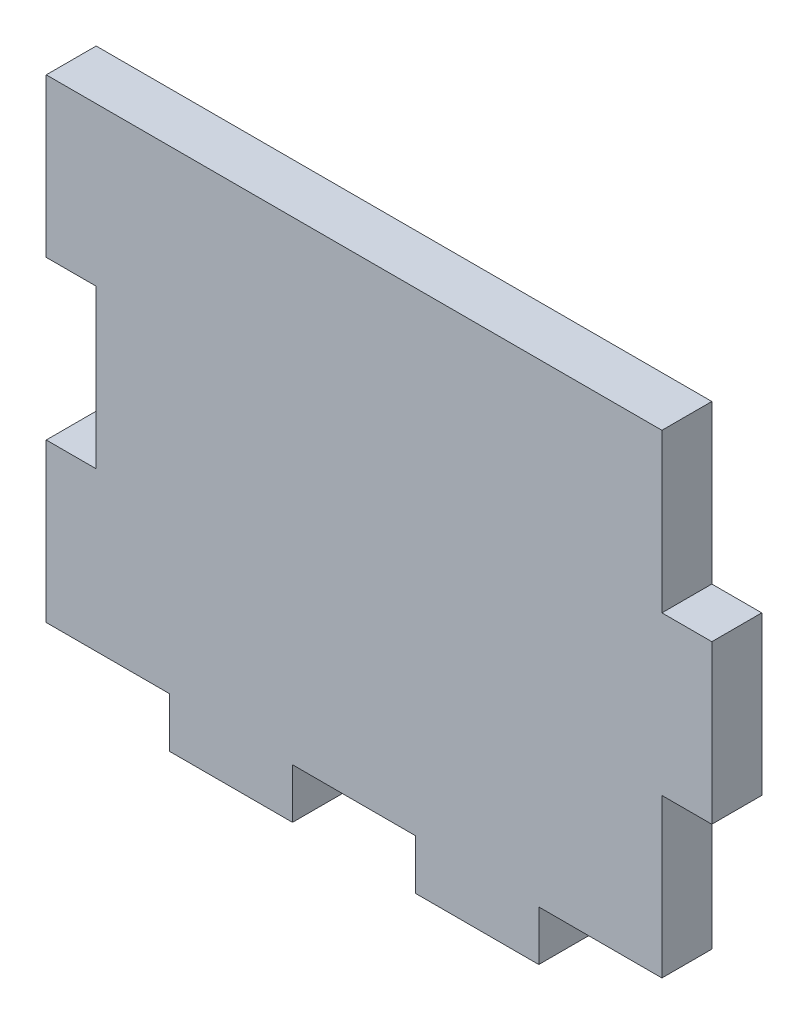
ISO-10303-21;
HEADER;
FILE_DESCRIPTION(('STEP AP214'),'2;1');
FILE_NAME('part.step','',(''),(''),'','','');
FILE_SCHEMA(('AUTOMOTIVE_DESIGN { 1 0 10303 214 1 1 1 1 }'));
ENDSEC;
DATA;
#1=APPLICATION_CONTEXT('core data for automotive mechanical design processes');
#2=APPLICATION_PROTOCOL_DEFINITION('international standard','automotive_design',2000,#1);
#3=PRODUCT_CONTEXT('',#1,'mechanical');
#4=PRODUCT('Part','Part','',(#3));
#5=PRODUCT_RELATED_PRODUCT_CATEGORY('part','',(#4));
#6=PRODUCT_DEFINITION_FORMATION('','',#4);
#7=PRODUCT_DEFINITION_CONTEXT('part definition',#1,'design');
#8=PRODUCT_DEFINITION('design','',#6,#7);
#9=PRODUCT_DEFINITION_SHAPE('','',#8);
#10=(LENGTH_UNIT() NAMED_UNIT(*) SI_UNIT(.MILLI.,.METRE.));
#11=(NAMED_UNIT(*) PLANE_ANGLE_UNIT() SI_UNIT($,.RADIAN.));
#12=(NAMED_UNIT(*) SI_UNIT($,.STERADIAN.) SOLID_ANGLE_UNIT());
#13=UNCERTAINTY_MEASURE_WITH_UNIT(LENGTH_MEASURE(1.E-05),#10,'distance_accuracy_value','');
#14=(GEOMETRIC_REPRESENTATION_CONTEXT(3) GLOBAL_UNCERTAINTY_ASSIGNED_CONTEXT((#13)) GLOBAL_UNIT_ASSIGNED_CONTEXT((#10,
#11,#12)) REPRESENTATION_CONTEXT('',''));
#15=CARTESIAN_POINT('',(0.,0.,0.));
#16=DIRECTION('',(0.,0.,1.));
#17=DIRECTION('',(1.,0.,0.));
#18=AXIS2_PLACEMENT_3D('',#15,#16,#17);
#19=CARTESIAN_POINT('',(0.,0.,4.5));
#20=DIRECTION('',(1.,0.,0.));
#21=DIRECTION('',(0.,0.,-1.));
#22=AXIS2_PLACEMENT_3D('',#19,#20,#21);
#23=PLANE('',#22);
#24=DIRECTION('',(0.,-1.,0.));
#25=VECTOR('',#24,1.);
#26=CARTESIAN_POINT('',(0.,0.,0.));
#27=LINE('',#26,#25);
#28=CARTESIAN_POINT('',(0.,14.2533333333333,0.));
#29=VERTEX_POINT('',#28);
#30=CARTESIAN_POINT('',(0.,0.,0.));
#31=VERTEX_POINT('',#30);
#32=EDGE_CURVE('E198',#29,#31,#27,.T.);
#33=ORIENTED_EDGE('',*,*,#32,.T.);
#34=DIRECTION('',(0.,0.,-1.));
#35=VECTOR('',#34,1.);
#36=CARTESIAN_POINT('',(0.,0.,4.5));
#37=LINE('',#36,#35);
#38=CARTESIAN_POINT('',(0.,0.,4.5));
#39=VERTEX_POINT('',#38);
#40=EDGE_CURVE('E11',#39,#31,#37,.T.);
#41=ORIENTED_EDGE('',*,*,#40,.F.);
#42=DIRECTION('',(0.,-1.,0.));
#43=VECTOR('',#42,1.);
#44=CARTESIAN_POINT('',(0.,0.,4.5));
#45=LINE('',#44,#43);
#46=CARTESIAN_POINT('',(0.,14.2533333333333,4.5));
#47=VERTEX_POINT('',#46);
#48=EDGE_CURVE('E237',#47,#39,#45,.T.);
#49=ORIENTED_EDGE('',*,*,#48,.F.);
#50=DIRECTION('',(0.,0.,-1.));
#51=VECTOR('',#50,1.);
#52=CARTESIAN_POINT('',(0.,14.2533333333333,4.5));
#53=LINE('',#52,#51);
#54=EDGE_CURVE('E194',#47,#29,#53,.T.);
#55=ORIENTED_EDGE('',*,*,#54,.T.);
#56=EDGE_LOOP('',(#33,#41,#49,#55));
#57=FACE_BOUND('',#56,.T.);
#58=ADVANCED_FACE('F30',(#57),#23,.F.);
#59=CARTESIAN_POINT('',(0.,0.,4.5));
#60=DIRECTION('',(0.,1.,0.));
#61=DIRECTION('',(0.,0.,1.));
#62=AXIS2_PLACEMENT_3D('',#59,#60,#61);
#63=PLANE('',#62);
#64=DIRECTION('',(1.,0.,0.));
#65=VECTOR('',#64,1.);
#66=CARTESIAN_POINT('',(0.,0.,0.));
#67=LINE('',#66,#65);
#68=CARTESIAN_POINT('',(11.1,0.,0.));
#69=VERTEX_POINT('',#68);
#70=EDGE_CURVE('E201',#31,#69,#67,.T.);
#71=ORIENTED_EDGE('',*,*,#70,.T.);
#72=DIRECTION('',(0.,0.,-1.));
#73=VECTOR('',#72,1.);
#74=CARTESIAN_POINT('',(11.1,0.,4.5));
#75=LINE('',#74,#73);
#76=CARTESIAN_POINT('',(11.1,0.,4.5));
#77=VERTEX_POINT('',#76);
#78=EDGE_CURVE('E38',#77,#69,#75,.T.);
#79=ORIENTED_EDGE('',*,*,#78,.F.);
#80=DIRECTION('',(1.,0.,0.));
#81=VECTOR('',#80,1.);
#82=CARTESIAN_POINT('',(0.,0.,4.5));
#83=LINE('',#82,#81);
#84=EDGE_CURVE('E125',#39,#77,#83,.T.);
#85=ORIENTED_EDGE('',*,*,#84,.F.);
#86=ORIENTED_EDGE('',*,*,#40,.T.);
#87=EDGE_LOOP('',(#71,#79,#85,#86));
#88=FACE_BOUND('',#87,.T.);
#89=ADVANCED_FACE('F354',(#88),#63,.F.);
#90=CARTESIAN_POINT('',(11.1,0.,4.5));
#91=DIRECTION('',(1.,0.,0.));
#92=DIRECTION('',(0.,1.,0.));
#93=AXIS2_PLACEMENT_3D('',#90,#91,#92);
#94=PLANE('',#93);
#95=DIRECTION('',(0.,-1.,0.));
#96=VECTOR('',#95,1.);
#97=CARTESIAN_POINT('',(11.1,0.,0.));
#98=LINE('',#97,#96);
#99=CARTESIAN_POINT('',(11.1,-4.5,0.));
#100=VERTEX_POINT('',#99);
#101=EDGE_CURVE('E203',#69,#100,#98,.T.);
#102=ORIENTED_EDGE('',*,*,#101,.T.);
#103=DIRECTION('',(0.,0.,-1.));
#104=VECTOR('',#103,1.);
#105=CARTESIAN_POINT('',(11.1,-4.5,4.5));
#106=LINE('',#105,#104);
#107=CARTESIAN_POINT('',(11.1,-4.5,4.5));
#108=VERTEX_POINT('',#107);
#109=EDGE_CURVE('E280',#108,#100,#106,.T.);
#110=ORIENTED_EDGE('',*,*,#109,.F.);
#111=DIRECTION('',(0.,-1.,0.));
#112=VECTOR('',#111,1.);
#113=CARTESIAN_POINT('',(11.1,0.,4.5));
#114=LINE('',#113,#112);
#115=EDGE_CURVE('E288',#77,#108,#114,.T.);
#116=ORIENTED_EDGE('',*,*,#115,.F.);
#117=ORIENTED_EDGE('',*,*,#78,.T.);
#118=EDGE_LOOP('',(#102,#110,#116,#117));
#119=FACE_BOUND('',#118,.T.);
#120=ADVANCED_FACE('F286',(#119),#94,.F.);
#121=CARTESIAN_POINT('',(11.1,-4.5,4.5));
#122=DIRECTION('',(0.,1.,0.));
#123=DIRECTION('',(0.,0.,1.));
#124=AXIS2_PLACEMENT_3D('',#121,#122,#123);
#125=PLANE('',#124);
#126=DIRECTION('',(1.,0.,0.));
#127=VECTOR('',#126,1.);
#128=CARTESIAN_POINT('',(11.1,-4.5,0.));
#129=LINE('',#128,#127);
#130=CARTESIAN_POINT('',(22.2,-4.5,0.));
#131=VERTEX_POINT('',#130);
#132=EDGE_CURVE('E205',#100,#131,#129,.T.);
#133=ORIENTED_EDGE('',*,*,#132,.T.);
#134=DIRECTION('',(0.,0.,-1.));
#135=VECTOR('',#134,1.);
#136=CARTESIAN_POINT('',(22.2,-4.5,4.5));
#137=LINE('',#136,#135);
#138=CARTESIAN_POINT('',(22.2,-4.5,4.5));
#139=VERTEX_POINT('',#138);
#140=EDGE_CURVE('E277',#139,#131,#137,.T.);
#141=ORIENTED_EDGE('',*,*,#140,.F.);
#142=DIRECTION('',(1.,0.,0.));
#143=VECTOR('',#142,1.);
#144=CARTESIAN_POINT('',(11.1,-4.5,4.5));
#145=LINE('',#144,#143);
#146=EDGE_CURVE('E306',#108,#139,#145,.T.);
#147=ORIENTED_EDGE('',*,*,#146,.F.);
#148=ORIENTED_EDGE('',*,*,#109,.T.);
#149=EDGE_LOOP('',(#133,#141,#147,#148));
#150=FACE_BOUND('',#149,.T.);
#151=ADVANCED_FACE('F297',(#150),#125,.F.);
#152=CARTESIAN_POINT('',(22.2,0.,4.5));
#153=DIRECTION('',(-1.,0.,0.));
#154=DIRECTION('',(0.,-1.,0.));
#155=AXIS2_PLACEMENT_3D('',#152,#153,#154);
#156=PLANE('',#155);
#157=DIRECTION('',(0.,1.,0.));
#158=VECTOR('',#157,1.);
#159=CARTESIAN_POINT('',(22.2,0.,0.));
#160=LINE('',#159,#158);
#161=CARTESIAN_POINT('',(22.2,0.,0.));
#162=VERTEX_POINT('',#161);
#163=EDGE_CURVE('E207',#131,#162,#160,.T.);
#164=ORIENTED_EDGE('',*,*,#163,.T.);
#165=DIRECTION('',(0.,0.,-1.));
#166=VECTOR('',#165,1.);
#167=CARTESIAN_POINT('',(22.2,0.,4.5));
#168=LINE('',#167,#166);
#169=CARTESIAN_POINT('',(22.2,0.,4.5));
#170=VERTEX_POINT('',#169);
#171=EDGE_CURVE('E274',#170,#162,#168,.T.);
#172=ORIENTED_EDGE('',*,*,#171,.F.);
#173=DIRECTION('',(0.,1.,0.));
#174=VECTOR('',#173,1.);
#175=CARTESIAN_POINT('',(22.2,0.,4.5));
#176=LINE('',#175,#174);
#177=EDGE_CURVE('E303',#139,#170,#176,.T.);
#178=ORIENTED_EDGE('',*,*,#177,.F.);
#179=ORIENTED_EDGE('',*,*,#140,.T.);
#180=EDGE_LOOP('',(#164,#172,#178,#179));
#181=FACE_BOUND('',#180,.T.);
#182=ADVANCED_FACE('F301',(#181),#156,.F.);
#183=CARTESIAN_POINT('',(22.2,0.,4.5));
#184=DIRECTION('',(0.,1.,0.));
#185=DIRECTION('',(0.,0.,1.));
#186=AXIS2_PLACEMENT_3D('',#183,#184,#185);
#187=PLANE('',#186);
#188=DIRECTION('',(1.,0.,0.));
#189=VECTOR('',#188,1.);
#190=CARTESIAN_POINT('',(22.2,0.,0.));
#191=LINE('',#190,#189);
#192=CARTESIAN_POINT('',(33.3,0.,0.));
#193=VERTEX_POINT('',#192);
#194=EDGE_CURVE('E209',#162,#193,#191,.T.);
#195=ORIENTED_EDGE('',*,*,#194,.T.);
#196=DIRECTION('',(0.,0.,-1.));
#197=VECTOR('',#196,1.);
#198=CARTESIAN_POINT('',(33.3,0.,4.5));
#199=LINE('',#198,#197);
#200=CARTESIAN_POINT('',(33.3,0.,4.5));
#201=VERTEX_POINT('',#200);
#202=EDGE_CURVE('E271',#201,#193,#199,.T.);
#203=ORIENTED_EDGE('',*,*,#202,.F.);
#204=DIRECTION('',(1.,0.,0.));
#205=VECTOR('',#204,1.);
#206=CARTESIAN_POINT('',(22.2,0.,4.5));
#207=LINE('',#206,#205);
#208=EDGE_CURVE('E305',#170,#201,#207,.T.);
#209=ORIENTED_EDGE('',*,*,#208,.F.);
#210=ORIENTED_EDGE('',*,*,#171,.T.);
#211=EDGE_LOOP('',(#195,#203,#209,#210));
#212=FACE_BOUND('',#211,.T.);
#213=ADVANCED_FACE('F367',(#212),#187,.F.);
#214=CARTESIAN_POINT('',(33.3,0.,4.5));
#215=DIRECTION('',(1.,0.,0.));
#216=DIRECTION('',(0.,1.,0.));
#217=AXIS2_PLACEMENT_3D('',#214,#215,#216);
#218=PLANE('',#217);
#219=DIRECTION('',(0.,-1.,0.));
#220=VECTOR('',#219,1.);
#221=CARTESIAN_POINT('',(33.3,0.,0.));
#222=LINE('',#221,#220);
#223=CARTESIAN_POINT('',(33.3,-4.5,0.));
#224=VERTEX_POINT('',#223);
#225=EDGE_CURVE('E211',#193,#224,#222,.T.);
#226=ORIENTED_EDGE('',*,*,#225,.T.);
#227=DIRECTION('',(0.,0.,-1.));
#228=VECTOR('',#227,1.);
#229=CARTESIAN_POINT('',(33.3,-4.5,4.5));
#230=LINE('',#229,#228);
#231=CARTESIAN_POINT('',(33.3,-4.5,4.5));
#232=VERTEX_POINT('',#231);
#233=EDGE_CURVE('E268',#232,#224,#230,.T.);
#234=ORIENTED_EDGE('',*,*,#233,.F.);
#235=DIRECTION('',(0.,-1.,0.));
#236=VECTOR('',#235,1.);
#237=CARTESIAN_POINT('',(33.3,0.,4.5));
#238=LINE('',#237,#236);
#239=EDGE_CURVE('E308',#201,#232,#238,.T.);
#240=ORIENTED_EDGE('',*,*,#239,.F.);
#241=ORIENTED_EDGE('',*,*,#202,.T.);
#242=EDGE_LOOP('',(#226,#234,#240,#241));
#243=FACE_BOUND('',#242,.T.);
#244=ADVANCED_FACE('F370',(#243),#218,.F.);
#245=CARTESIAN_POINT('',(33.3,-4.5,4.5));
#246=DIRECTION('',(0.,1.,0.));
#247=DIRECTION('',(0.,0.,1.));
#248=AXIS2_PLACEMENT_3D('',#245,#246,#247);
#249=PLANE('',#248);
#250=DIRECTION('',(1.,0.,0.));
#251=VECTOR('',#250,1.);
#252=CARTESIAN_POINT('',(33.3,-4.5,0.));
#253=LINE('',#252,#251);
#254=CARTESIAN_POINT('',(44.4,-4.5,0.));
#255=VERTEX_POINT('',#254);
#256=EDGE_CURVE('E213',#224,#255,#253,.T.);
#257=ORIENTED_EDGE('',*,*,#256,.T.);
#258=DIRECTION('',(0.,0.,-1.));
#259=VECTOR('',#258,1.);
#260=CARTESIAN_POINT('',(44.4,-4.5,4.5));
#261=LINE('',#260,#259);
#262=CARTESIAN_POINT('',(44.4,-4.5,4.5));
#263=VERTEX_POINT('',#262);
#264=EDGE_CURVE('E265',#263,#255,#261,.T.);
#265=ORIENTED_EDGE('',*,*,#264,.F.);
#266=DIRECTION('',(1.,0.,0.));
#267=VECTOR('',#266,1.);
#268=CARTESIAN_POINT('',(33.3,-4.5,4.5));
#269=LINE('',#268,#267);
#270=EDGE_CURVE('E314',#232,#263,#269,.T.);
#271=ORIENTED_EDGE('',*,*,#270,.F.);
#272=ORIENTED_EDGE('',*,*,#233,.T.);
#273=EDGE_LOOP('',(#257,#265,#271,#272));
#274=FACE_BOUND('',#273,.T.);
#275=ADVANCED_FACE('F374',(#274),#249,.F.);
#276=CARTESIAN_POINT('',(44.4,0.,4.5));
#277=DIRECTION('',(-1.,0.,0.));
#278=DIRECTION('',(0.,-1.,0.));
#279=AXIS2_PLACEMENT_3D('',#276,#277,#278);
#280=PLANE('',#279);
#281=DIRECTION('',(0.,1.,0.));
#282=VECTOR('',#281,1.);
#283=CARTESIAN_POINT('',(44.4,0.,0.));
#284=LINE('',#283,#282);
#285=CARTESIAN_POINT('',(44.4,0.,0.));
#286=VERTEX_POINT('',#285);
#287=EDGE_CURVE('E215',#255,#286,#284,.T.);
#288=ORIENTED_EDGE('',*,*,#287,.T.);
#289=DIRECTION('',(0.,0.,-1.));
#290=VECTOR('',#289,1.);
#291=CARTESIAN_POINT('',(44.4,0.,4.5));
#292=LINE('',#291,#290);
#293=CARTESIAN_POINT('',(44.4,0.,4.5));
#294=VERTEX_POINT('',#293);
#295=EDGE_CURVE('E262',#294,#286,#292,.T.);
#296=ORIENTED_EDGE('',*,*,#295,.F.);
#297=DIRECTION('',(0.,1.,0.));
#298=VECTOR('',#297,1.);
#299=CARTESIAN_POINT('',(44.4,0.,4.5));
#300=LINE('',#299,#298);
#301=EDGE_CURVE('E316',#263,#294,#300,.T.);
#302=ORIENTED_EDGE('',*,*,#301,.F.);
#303=ORIENTED_EDGE('',*,*,#264,.T.);
#304=EDGE_LOOP('',(#288,#296,#302,#303));
#305=FACE_BOUND('',#304,.T.);
#306=ADVANCED_FACE('F378',(#305),#280,.F.);
#307=CARTESIAN_POINT('',(44.4,0.,4.5));
#308=DIRECTION('',(0.,1.,0.));
#309=DIRECTION('',(0.,0.,1.));
#310=AXIS2_PLACEMENT_3D('',#307,#308,#309);
#311=PLANE('',#310);
#312=DIRECTION('',(1.,0.,0.));
#313=VECTOR('',#312,1.);
#314=CARTESIAN_POINT('',(44.4,0.,0.));
#315=LINE('',#314,#313);
#316=CARTESIAN_POINT('',(55.5,0.,0.));
#317=VERTEX_POINT('',#316);
#318=EDGE_CURVE('E217',#286,#317,#315,.T.);
#319=ORIENTED_EDGE('',*,*,#318,.T.);
#320=DIRECTION('',(0.,0.,-1.));
#321=VECTOR('',#320,1.);
#322=CARTESIAN_POINT('',(55.5,0.,4.5));
#323=LINE('',#322,#321);
#324=CARTESIAN_POINT('',(55.5,0.,4.5));
#325=VERTEX_POINT('',#324);
#326=EDGE_CURVE('E259',#325,#317,#323,.T.);
#327=ORIENTED_EDGE('',*,*,#326,.F.);
#328=DIRECTION('',(1.,0.,0.));
#329=VECTOR('',#328,1.);
#330=CARTESIAN_POINT('',(44.4,0.,4.5));
#331=LINE('',#330,#329);
#332=EDGE_CURVE('E318',#294,#325,#331,.T.);
#333=ORIENTED_EDGE('',*,*,#332,.F.);
#334=ORIENTED_EDGE('',*,*,#295,.T.);
#335=EDGE_LOOP('',(#319,#327,#333,#334));
#336=FACE_BOUND('',#335,.T.);
#337=ADVANCED_FACE('F382',(#336),#311,.F.);
#338=CARTESIAN_POINT('',(55.5,0.,4.5));
#339=DIRECTION('',(-1.,0.,0.));
#340=DIRECTION('',(0.,0.,1.));
#341=AXIS2_PLACEMENT_3D('',#338,#339,#340);
#342=PLANE('',#341);
#343=DIRECTION('',(0.,1.,0.));
#344=VECTOR('',#343,1.);
#345=CARTESIAN_POINT('',(55.5,0.,0.));
#346=LINE('',#345,#344);
#347=CARTESIAN_POINT('',(55.5,14.2533333333333,0.));
#348=VERTEX_POINT('',#347);
#349=EDGE_CURVE('E219',#317,#348,#346,.T.);
#350=ORIENTED_EDGE('',*,*,#349,.T.);
#351=DIRECTION('',(0.,0.,-1.));
#352=VECTOR('',#351,1.);
#353=CARTESIAN_POINT('',(55.5,14.2533333333333,4.5));
#354=LINE('',#353,#352);
#355=CARTESIAN_POINT('',(55.5,14.2533333333333,4.5));
#356=VERTEX_POINT('',#355);
#357=EDGE_CURVE('E256',#356,#348,#354,.T.);
#358=ORIENTED_EDGE('',*,*,#357,.F.);
#359=DIRECTION('',(0.,1.,0.));
#360=VECTOR('',#359,1.);
#361=CARTESIAN_POINT('',(55.5,0.,4.5));
#362=LINE('',#361,#360);
#363=EDGE_CURVE('E320',#325,#356,#362,.T.);
#364=ORIENTED_EDGE('',*,*,#363,.F.);
#365=ORIENTED_EDGE('',*,*,#326,.T.);
#366=EDGE_LOOP('',(#350,#358,#364,#365));
#367=FACE_BOUND('',#366,.T.);
#368=ADVANCED_FACE('F386',(#367),#342,.F.);
#369=CARTESIAN_POINT('',(55.5,14.2533333333333,4.5));
#370=DIRECTION('',(0.,1.,0.));
#371=DIRECTION('',(0.,0.,1.));
#372=AXIS2_PLACEMENT_3D('',#369,#370,#371);
#373=PLANE('',#372);
#374=DIRECTION('',(1.,0.,0.));
#375=VECTOR('',#374,1.);
#376=CARTESIAN_POINT('',(55.5,14.2533333333333,0.));
#377=LINE('',#376,#375);
#378=CARTESIAN_POINT('',(60.,14.2533333333333,0.));
#379=VERTEX_POINT('',#378);
#380=EDGE_CURVE('E221',#348,#379,#377,.T.);
#381=ORIENTED_EDGE('',*,*,#380,.T.);
#382=DIRECTION('',(0.,0.,-1.));
#383=VECTOR('',#382,1.);
#384=CARTESIAN_POINT('',(60.,14.2533333333333,4.5));
#385=LINE('',#384,#383);
#386=CARTESIAN_POINT('',(60.,14.2533333333333,4.5));
#387=VERTEX_POINT('',#386);
#388=EDGE_CURVE('E253',#387,#379,#385,.T.);
#389=ORIENTED_EDGE('',*,*,#388,.F.);
#390=DIRECTION('',(1.,0.,0.));
#391=VECTOR('',#390,1.);
#392=CARTESIAN_POINT('',(55.5,14.2533333333333,4.5));
#393=LINE('',#392,#391);
#394=EDGE_CURVE('E322',#356,#387,#393,.T.);
#395=ORIENTED_EDGE('',*,*,#394,.F.);
#396=ORIENTED_EDGE('',*,*,#357,.T.);
#397=EDGE_LOOP('',(#381,#389,#395,#396));
#398=FACE_BOUND('',#397,.T.);
#399=ADVANCED_FACE('F390',(#398),#373,.F.);
#400=CARTESIAN_POINT('',(60.,14.2533333333333,4.5));
#401=DIRECTION('',(-1.,0.,0.));
#402=DIRECTION('',(0.,0.,1.));
#403=AXIS2_PLACEMENT_3D('',#400,#401,#402);
#404=PLANE('',#403);
#405=DIRECTION('',(0.,1.,0.));
#406=VECTOR('',#405,1.);
#407=CARTESIAN_POINT('',(60.,14.2533333333333,0.));
#408=LINE('',#407,#406);
#409=CARTESIAN_POINT('',(60.,28.5066666666667,0.));
#410=VERTEX_POINT('',#409);
#411=EDGE_CURVE('E223',#379,#410,#408,.T.);
#412=ORIENTED_EDGE('',*,*,#411,.T.);
#413=DIRECTION('',(0.,0.,-1.));
#414=VECTOR('',#413,1.);
#415=CARTESIAN_POINT('',(60.,28.5066666666667,4.5));
#416=LINE('',#415,#414);
#417=CARTESIAN_POINT('',(60.,28.5066666666667,4.5));
#418=VERTEX_POINT('',#417);
#419=EDGE_CURVE('E250',#418,#410,#416,.T.);
#420=ORIENTED_EDGE('',*,*,#419,.F.);
#421=DIRECTION('',(0.,1.,0.));
#422=VECTOR('',#421,1.);
#423=CARTESIAN_POINT('',(60.,14.2533333333333,4.5));
#424=LINE('',#423,#422);
#425=EDGE_CURVE('E324',#387,#418,#424,.T.);
#426=ORIENTED_EDGE('',*,*,#425,.F.);
#427=ORIENTED_EDGE('',*,*,#388,.T.);
#428=EDGE_LOOP('',(#412,#420,#426,#427));
#429=FACE_BOUND('',#428,.T.);
#430=ADVANCED_FACE('F394',(#429),#404,.F.);
#431=CARTESIAN_POINT('',(55.5,28.5066666666667,4.5));
#432=DIRECTION('',(0.,-1.,0.));
#433=DIRECTION('',(0.,0.,-1.));
#434=AXIS2_PLACEMENT_3D('',#431,#432,#433);
#435=PLANE('',#434);
#436=DIRECTION('',(-1.,0.,0.));
#437=VECTOR('',#436,1.);
#438=CARTESIAN_POINT('',(55.5,28.5066666666667,0.));
#439=LINE('',#438,#437);
#440=CARTESIAN_POINT('',(55.5,28.5066666666667,0.));
#441=VERTEX_POINT('',#440);
#442=EDGE_CURVE('E225',#410,#441,#439,.T.);
#443=ORIENTED_EDGE('',*,*,#442,.T.);
#444=DIRECTION('',(0.,0.,-1.));
#445=VECTOR('',#444,1.);
#446=CARTESIAN_POINT('',(55.5,28.5066666666667,4.5));
#447=LINE('',#446,#445);
#448=CARTESIAN_POINT('',(55.5,28.5066666666667,4.5));
#449=VERTEX_POINT('',#448);
#450=EDGE_CURVE('E247',#449,#441,#447,.T.);
#451=ORIENTED_EDGE('',*,*,#450,.F.);
#452=DIRECTION('',(-1.,0.,0.));
#453=VECTOR('',#452,1.);
#454=CARTESIAN_POINT('',(55.5,28.5066666666667,4.5));
#455=LINE('',#454,#453);
#456=EDGE_CURVE('E326',#418,#449,#455,.T.);
#457=ORIENTED_EDGE('',*,*,#456,.F.);
#458=ORIENTED_EDGE('',*,*,#419,.T.);
#459=EDGE_LOOP('',(#443,#451,#457,#458));
#460=FACE_BOUND('',#459,.T.);
#461=ADVANCED_FACE('F398',(#460),#435,.F.);
#462=CARTESIAN_POINT('',(55.5,28.5066666666667,4.5));
#463=DIRECTION('',(-1.,0.,0.));
#464=DIRECTION('',(0.,0.,1.));
#465=AXIS2_PLACEMENT_3D('',#462,#463,#464);
#466=PLANE('',#465);
#467=DIRECTION('',(0.,1.,0.));
#468=VECTOR('',#467,1.);
#469=CARTESIAN_POINT('',(55.5,28.5066666666667,0.));
#470=LINE('',#469,#468);
#471=CARTESIAN_POINT('',(55.5,42.76,0.));
#472=VERTEX_POINT('',#471);
#473=EDGE_CURVE('E227',#441,#472,#470,.T.);
#474=ORIENTED_EDGE('',*,*,#473,.T.);
#475=DIRECTION('',(0.,0.,-1.));
#476=VECTOR('',#475,1.);
#477=CARTESIAN_POINT('',(55.5,42.76,4.5));
#478=LINE('',#477,#476);
#479=CARTESIAN_POINT('',(55.5,42.76,4.5));
#480=VERTEX_POINT('',#479);
#481=EDGE_CURVE('E244',#480,#472,#478,.T.);
#482=ORIENTED_EDGE('',*,*,#481,.F.);
#483=DIRECTION('',(0.,1.,0.));
#484=VECTOR('',#483,1.);
#485=CARTESIAN_POINT('',(55.5,28.5066666666667,4.5));
#486=LINE('',#485,#484);
#487=EDGE_CURVE('E328',#449,#480,#486,.T.);
#488=ORIENTED_EDGE('',*,*,#487,.F.);
#489=ORIENTED_EDGE('',*,*,#450,.T.);
#490=EDGE_LOOP('',(#474,#482,#488,#489));
#491=FACE_BOUND('',#490,.T.);
#492=ADVANCED_FACE('F402',(#491),#466,.F.);
#493=CARTESIAN_POINT('',(0.,42.76,4.5));
#494=DIRECTION('',(0.,-1.,0.));
#495=DIRECTION('',(0.,0.,-1.));
#496=AXIS2_PLACEMENT_3D('',#493,#494,#495);
#497=PLANE('',#496);
#498=DIRECTION('',(-1.,0.,0.));
#499=VECTOR('',#498,1.);
#500=CARTESIAN_POINT('',(0.,42.76,0.));
#501=LINE('',#500,#499);
#502=CARTESIAN_POINT('',(0.,42.76,0.));
#503=VERTEX_POINT('',#502);
#504=EDGE_CURVE('E230',#472,#503,#501,.T.);
#505=ORIENTED_EDGE('',*,*,#504,.T.);
#506=DIRECTION('',(0.,0.,-1.));
#507=VECTOR('',#506,1.);
#508=CARTESIAN_POINT('',(0.,42.76,4.5));
#509=LINE('',#508,#507);
#510=CARTESIAN_POINT('',(0.,42.76,4.5));
#511=VERTEX_POINT('',#510);
#512=EDGE_CURVE('E241',#511,#503,#509,.T.);
#513=ORIENTED_EDGE('',*,*,#512,.F.);
#514=DIRECTION('',(-1.,0.,0.));
#515=VECTOR('',#514,1.);
#516=CARTESIAN_POINT('',(40.,42.76,4.5));
#517=LINE('',#516,#515);
#518=EDGE_CURVE('E330',#480,#511,#517,.T.);
#519=ORIENTED_EDGE('',*,*,#518,.F.);
#520=ORIENTED_EDGE('',*,*,#481,.T.);
#521=EDGE_LOOP('',(#505,#513,#519,#520));
#522=FACE_BOUND('',#521,.T.);
#523=ADVANCED_FACE('F336',(#522),#497,.F.);
#524=CARTESIAN_POINT('',(0.,28.5066666666667,4.5));
#525=DIRECTION('',(1.,0.,0.));
#526=DIRECTION('',(0.,0.,-1.));
#527=AXIS2_PLACEMENT_3D('',#524,#525,#526);
#528=PLANE('',#527);
#529=DIRECTION('',(0.,-1.,0.));
#530=VECTOR('',#529,1.);
#531=CARTESIAN_POINT('',(0.,28.5066666666667,0.));
#532=LINE('',#531,#530);
#533=CARTESIAN_POINT('',(0.,28.5066666666667,0.));
#534=VERTEX_POINT('',#533);
#535=EDGE_CURVE('E232',#503,#534,#532,.T.);
#536=ORIENTED_EDGE('',*,*,#535,.T.);
#537=DIRECTION('',(0.,0.,-1.));
#538=VECTOR('',#537,1.);
#539=CARTESIAN_POINT('',(0.,28.5066666666667,4.5));
#540=LINE('',#539,#538);
#541=CARTESIAN_POINT('',(0.,28.5066666666667,4.5));
#542=VERTEX_POINT('',#541);
#543=EDGE_CURVE('E189',#542,#534,#540,.T.);
#544=ORIENTED_EDGE('',*,*,#543,.F.);
#545=DIRECTION('',(0.,-1.,0.));
#546=VECTOR('',#545,1.);
#547=CARTESIAN_POINT('',(0.,28.5066666666667,4.5));
#548=LINE('',#547,#546);
#549=EDGE_CURVE('E180',#511,#542,#548,.T.);
#550=ORIENTED_EDGE('',*,*,#549,.F.);
#551=ORIENTED_EDGE('',*,*,#512,.T.);
#552=EDGE_LOOP('',(#536,#544,#550,#551));
#553=FACE_BOUND('',#552,.T.);
#554=ADVANCED_FACE('F339',(#553),#528,.F.);
#555=CARTESIAN_POINT('',(0.,28.5066666666667,4.5));
#556=DIRECTION('',(0.,1.,0.));
#557=DIRECTION('',(-1.,0.,0.));
#558=AXIS2_PLACEMENT_3D('',#555,#556,#557);
#559=PLANE('',#558);
#560=DIRECTION('',(1.,0.,0.));
#561=VECTOR('',#560,1.);
#562=CARTESIAN_POINT('',(0.,28.5066666666667,0.));
#563=LINE('',#562,#561);
#564=CARTESIAN_POINT('',(4.5,28.5066666666667,0.));
#565=VERTEX_POINT('',#564);
#566=EDGE_CURVE('E188',#534,#565,#563,.T.);
#567=ORIENTED_EDGE('',*,*,#566,.T.);
#568=DIRECTION('',(0.,0.,-1.));
#569=VECTOR('',#568,1.);
#570=CARTESIAN_POINT('',(4.5,28.5066666666667,4.5));
#571=LINE('',#570,#569);
#572=CARTESIAN_POINT('',(4.5,28.5066666666667,4.5));
#573=VERTEX_POINT('',#572);
#574=EDGE_CURVE('E185',#573,#565,#571,.T.);
#575=ORIENTED_EDGE('',*,*,#574,.F.);
#576=DIRECTION('',(1.,0.,0.));
#577=VECTOR('',#576,1.);
#578=CARTESIAN_POINT('',(0.,28.5066666666667,4.5));
#579=LINE('',#578,#577);
#580=EDGE_CURVE('E174',#542,#573,#579,.T.);
#581=ORIENTED_EDGE('',*,*,#580,.F.);
#582=ORIENTED_EDGE('',*,*,#543,.T.);
#583=EDGE_LOOP('',(#567,#575,#581,#582));
#584=FACE_BOUND('',#583,.T.);
#585=ADVANCED_FACE('F186',(#584),#559,.F.);
#586=CARTESIAN_POINT('',(4.5,28.5066666666667,4.5));
#587=DIRECTION('',(1.,0.,0.));
#588=DIRECTION('',(0.,0.,-1.));
#589=AXIS2_PLACEMENT_3D('',#586,#587,#588);
#590=PLANE('',#589);
#591=DIRECTION('',(0.,-1.,0.));
#592=VECTOR('',#591,1.);
#593=CARTESIAN_POINT('',(4.5,28.5066666666667,0.));
#594=LINE('',#593,#592);
#595=CARTESIAN_POINT('',(4.5,14.2533333333333,0.));
#596=VERTEX_POINT('',#595);
#597=EDGE_CURVE('E111',#565,#596,#594,.T.);
#598=ORIENTED_EDGE('',*,*,#597,.T.);
#599=DIRECTION('',(0.,0.,-1.));
#600=VECTOR('',#599,1.);
#601=CARTESIAN_POINT('',(4.5,14.2533333333333,4.5));
#602=LINE('',#601,#600);
#603=CARTESIAN_POINT('',(4.5,14.2533333333333,4.5));
#604=VERTEX_POINT('',#603);
#605=EDGE_CURVE('E190',#604,#596,#602,.T.);
#606=ORIENTED_EDGE('',*,*,#605,.F.);
#607=DIRECTION('',(0.,-1.,0.));
#608=VECTOR('',#607,1.);
#609=CARTESIAN_POINT('',(4.5,28.5066666666667,4.5));
#610=LINE('',#609,#608);
#611=EDGE_CURVE('E178',#573,#604,#610,.T.);
#612=ORIENTED_EDGE('',*,*,#611,.F.);
#613=ORIENTED_EDGE('',*,*,#574,.T.);
#614=EDGE_LOOP('',(#598,#606,#612,#613));
#615=FACE_BOUND('',#614,.T.);
#616=ADVANCED_FACE('F192',(#615),#590,.F.);
#617=CARTESIAN_POINT('',(0.,14.2533333333333,4.5));
#618=DIRECTION('',(0.,-1.,0.));
#619=DIRECTION('',(0.,0.,-1.));
#620=AXIS2_PLACEMENT_3D('',#617,#618,#619);
#621=PLANE('',#620);
#622=DIRECTION('',(-1.,0.,0.));
#623=VECTOR('',#622,1.);
#624=CARTESIAN_POINT('',(0.,14.2533333333333,0.));
#625=LINE('',#624,#623);
#626=EDGE_CURVE('E117',#596,#29,#625,.T.);
#627=ORIENTED_EDGE('',*,*,#626,.T.);
#628=ORIENTED_EDGE('',*,*,#54,.F.);
#629=DIRECTION('',(-1.,0.,0.));
#630=VECTOR('',#629,1.);
#631=CARTESIAN_POINT('',(0.,14.2533333333333,4.5));
#632=LINE('',#631,#630);
#633=EDGE_CURVE('E46',#604,#47,#632,.T.);
#634=ORIENTED_EDGE('',*,*,#633,.F.);
#635=ORIENTED_EDGE('',*,*,#605,.T.);
#636=EDGE_LOOP('',(#627,#628,#634,#635));
#637=FACE_BOUND('',#636,.T.);
#638=ADVANCED_FACE('F343',(#637),#621,.F.);
#639=CARTESIAN_POINT('',(0.,14.2533333333333,4.5));
#640=DIRECTION('',(0.,0.,-1.));
#641=DIRECTION('',(-1.,0.,0.));
#642=AXIS2_PLACEMENT_3D('',#639,#640,#641);
#643=PLANE('',#642);
#644=ORIENTED_EDGE('',*,*,#48,.T.);
#645=ORIENTED_EDGE('',*,*,#84,.T.);
#646=ORIENTED_EDGE('',*,*,#115,.T.);
#647=ORIENTED_EDGE('',*,*,#146,.T.);
#648=ORIENTED_EDGE('',*,*,#177,.T.);
#649=ORIENTED_EDGE('',*,*,#208,.T.);
#650=ORIENTED_EDGE('',*,*,#239,.T.);
#651=ORIENTED_EDGE('',*,*,#270,.T.);
#652=ORIENTED_EDGE('',*,*,#301,.T.);
#653=ORIENTED_EDGE('',*,*,#332,.T.);
#654=ORIENTED_EDGE('',*,*,#363,.T.);
#655=ORIENTED_EDGE('',*,*,#394,.T.);
#656=ORIENTED_EDGE('',*,*,#425,.T.);
#657=ORIENTED_EDGE('',*,*,#456,.T.);
#658=ORIENTED_EDGE('',*,*,#487,.T.);
#659=ORIENTED_EDGE('',*,*,#518,.T.);
#660=ORIENTED_EDGE('',*,*,#549,.T.);
#661=ORIENTED_EDGE('',*,*,#580,.T.);
#662=ORIENTED_EDGE('',*,*,#611,.T.);
#663=ORIENTED_EDGE('',*,*,#633,.T.);
#664=EDGE_LOOP('',(#644,#645,#646,#647,#648,#649,#650,#651,#652,#653,#654,#655,#656,#657,#658,
#659,#660,#661,#662,#663));
#665=FACE_BOUND('',#664,.T.);
#666=ADVANCED_FACE('F176',(#665),#643,.F.);
#667=CARTESIAN_POINT('',(0.,14.2533333333333,0.));
#668=DIRECTION('',(0.,0.,-1.));
#669=DIRECTION('',(-1.,0.,0.));
#670=AXIS2_PLACEMENT_3D('',#667,#668,#669);
#671=PLANE('',#670);
#672=ORIENTED_EDGE('',*,*,#32,.F.);
#673=ORIENTED_EDGE('',*,*,#626,.F.);
#674=ORIENTED_EDGE('',*,*,#597,.F.);
#675=ORIENTED_EDGE('',*,*,#566,.F.);
#676=ORIENTED_EDGE('',*,*,#535,.F.);
#677=ORIENTED_EDGE('',*,*,#504,.F.);
#678=ORIENTED_EDGE('',*,*,#473,.F.);
#679=ORIENTED_EDGE('',*,*,#442,.F.);
#680=ORIENTED_EDGE('',*,*,#411,.F.);
#681=ORIENTED_EDGE('',*,*,#380,.F.);
#682=ORIENTED_EDGE('',*,*,#349,.F.);
#683=ORIENTED_EDGE('',*,*,#318,.F.);
#684=ORIENTED_EDGE('',*,*,#287,.F.);
#685=ORIENTED_EDGE('',*,*,#256,.F.);
#686=ORIENTED_EDGE('',*,*,#225,.F.);
#687=ORIENTED_EDGE('',*,*,#194,.F.);
#688=ORIENTED_EDGE('',*,*,#163,.F.);
#689=ORIENTED_EDGE('',*,*,#132,.F.);
#690=ORIENTED_EDGE('',*,*,#101,.F.);
#691=ORIENTED_EDGE('',*,*,#70,.F.);
#692=EDGE_LOOP('',(#672,#673,#674,#675,#676,#677,#678,#679,#680,#681,#682,#683,#684,#685,#686,
#687,#688,#689,#690,#691));
#693=FACE_BOUND('',#692,.T.);
#694=ADVANCED_FACE('F292',(#693),#671,.T.);
#695=CLOSED_SHELL('',(#58,#89,#120,#151,#182,#213,#244,#275,#306,#337,#368,#399,#430,#461,#492,
#523,#554,#585,#616,#638,#666,#694));
#696=MANIFOLD_SOLID_BREP('B2',#695);
#697=ADVANCED_BREP_SHAPE_REPRESENTATION('',(#18,#696),#14);
#698=SHAPE_DEFINITION_REPRESENTATION(#9,#697);
ENDSEC;
END-ISO-10303-21;
